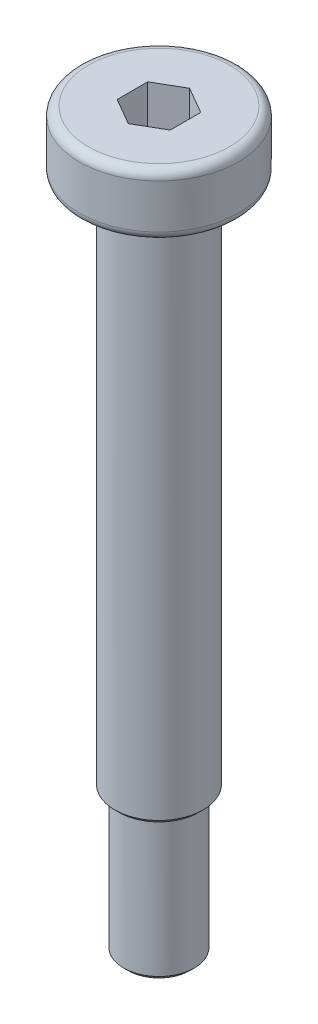
ISO-10303-21;
HEADER;
FILE_DESCRIPTION(('STEP AP214'),'2;1');
FILE_NAME('part.step','',(''),(''),'','','');
FILE_SCHEMA(('AUTOMOTIVE_DESIGN { 1 0 10303 214 1 1 1 1 }'));
ENDSEC;
DATA;
#1=APPLICATION_CONTEXT('core data for automotive mechanical design processes');
#2=APPLICATION_PROTOCOL_DEFINITION('international standard','automotive_design',2000,#1);
#3=PRODUCT_CONTEXT('',#1,'mechanical');
#4=PRODUCT('Part','Part','',(#3));
#5=PRODUCT_RELATED_PRODUCT_CATEGORY('part','',(#4));
#6=PRODUCT_DEFINITION_FORMATION('','',#4);
#7=PRODUCT_DEFINITION_CONTEXT('part definition',#1,'design');
#8=PRODUCT_DEFINITION('design','',#6,#7);
#9=PRODUCT_DEFINITION_SHAPE('','',#8);
#10=(LENGTH_UNIT() NAMED_UNIT(*) SI_UNIT(.MILLI.,.METRE.));
#11=(NAMED_UNIT(*) PLANE_ANGLE_UNIT() SI_UNIT($,.RADIAN.));
#12=(NAMED_UNIT(*) SI_UNIT($,.STERADIAN.) SOLID_ANGLE_UNIT());
#13=UNCERTAINTY_MEASURE_WITH_UNIT(LENGTH_MEASURE(1.E-05),#10,'distance_accuracy_value','');
#14=(GEOMETRIC_REPRESENTATION_CONTEXT(3) GLOBAL_UNCERTAINTY_ASSIGNED_CONTEXT((#13)) GLOBAL_UNIT_ASSIGNED_CONTEXT((#10,
#11,#12)) REPRESENTATION_CONTEXT('',''));
#15=CARTESIAN_POINT('',(0.,0.,0.));
#16=DIRECTION('',(0.,0.,1.));
#17=DIRECTION('',(1.,0.,0.));
#18=AXIS2_PLACEMENT_3D('',#15,#16,#17);
#19=CARTESIAN_POINT('',(0.,3.5,0.));
#20=DIRECTION('',(0.,1.,0.));
#21=DIRECTION('',(-1.,0.,0.));
#22=AXIS2_PLACEMENT_3D('',#19,#20,#21);
#23=CYLINDRICAL_SURFACE('',#22,2.25);
#24=CARTESIAN_POINT('',(0.,-1.,0.));
#25=DIRECTION('',(0.,1.,0.));
#26=DIRECTION('',(-1.,0.,0.));
#27=AXIS2_PLACEMENT_3D('',#24,#25,#26);
#28=CIRCLE('',#27,2.25);
#29=CARTESIAN_POINT('',(-2.25,-1.,0.));
#30=VERTEX_POINT('',#29);
#31=EDGE_CURVE('E119',#30,#30,#28,.T.);
#32=ORIENTED_EDGE('',*,*,#31,.T.);
#33=EDGE_LOOP('',(#32));
#34=FACE_BOUND('',#33,.T.);
#35=CARTESIAN_POINT('',(0.,0.,0.));
#36=DIRECTION('',(0.,1.,0.));
#37=DIRECTION('',(-1.,0.,0.));
#38=AXIS2_PLACEMENT_3D('',#35,#36,#37);
#39=CIRCLE('',#38,2.25);
#40=CARTESIAN_POINT('',(-2.25,0.,0.));
#41=VERTEX_POINT('',#40);
#42=EDGE_CURVE('E133',#41,#41,#39,.T.);
#43=ORIENTED_EDGE('',*,*,#42,.F.);
#44=EDGE_LOOP('',(#43));
#45=FACE_BOUND('',#44,.T.);
#46=ADVANCED_FACE('F16',(#34,#45),#23,.T.);
#47=CARTESIAN_POINT('',(-2.25,0.,0.));
#48=DIRECTION('',(0.,-1.,0.));
#49=DIRECTION('',(1.,0.,0.));
#50=AXIS2_PLACEMENT_3D('',#47,#48,#49);
#51=PLANE('',#50);
#52=CARTESIAN_POINT('',(0.,0.,0.));
#53=DIRECTION('',(0.,-1.,0.));
#54=DIRECTION('',(1.,0.,0.));
#55=AXIS2_PLACEMENT_3D('',#52,#53,#54);
#56=CIRCLE('',#55,4.);
#57=CARTESIAN_POINT('',(4.,0.,0.));
#58=VERTEX_POINT('',#57);
#59=EDGE_CURVE('E142',#58,#58,#56,.T.);
#60=ORIENTED_EDGE('',*,*,#59,.T.);
#61=EDGE_LOOP('',(#60));
#62=FACE_BOUND('',#61,.T.);
#63=ORIENTED_EDGE('',*,*,#42,.T.);
#64=EDGE_LOOP('',(#63));
#65=FACE_BOUND('',#64,.T.);
#66=ADVANCED_FACE('F170',(#62,#65),#51,.T.);
#67=CARTESIAN_POINT('',(0.,3.5,0.));
#68=DIRECTION('',(0.,1.,0.));
#69=DIRECTION('',(-1.,0.,0.));
#70=AXIS2_PLACEMENT_3D('',#67,#68,#69);
#71=CYLINDRICAL_SURFACE('',#70,4.5);
#72=CARTESIAN_POINT('',(0.,0.5,0.));
#73=DIRECTION('',(0.,-1.,0.));
#74=DIRECTION('',(1.,0.,0.));
#75=AXIS2_PLACEMENT_3D('',#72,#73,#74);
#76=CIRCLE('',#75,4.5);
#77=CARTESIAN_POINT('',(4.5,0.500000000000001,0.));
#78=VERTEX_POINT('',#77);
#79=EDGE_CURVE('E139',#78,#78,#76,.F.);
#80=ORIENTED_EDGE('',*,*,#79,.T.);
#81=EDGE_LOOP('',(#80));
#82=FACE_BOUND('',#81,.T.);
#83=CARTESIAN_POINT('',(0.,3.,0.));
#84=DIRECTION('',(0.,1.,0.));
#85=DIRECTION('',(-1.,0.,0.));
#86=AXIS2_PLACEMENT_3D('',#83,#84,#85);
#87=CIRCLE('',#86,4.5);
#88=CARTESIAN_POINT('',(-4.5,3.,0.));
#89=VERTEX_POINT('',#88);
#90=EDGE_CURVE('E136',#89,#89,#87,.F.);
#91=ORIENTED_EDGE('',*,*,#90,.T.);
#92=EDGE_LOOP('',(#91));
#93=FACE_BOUND('',#92,.T.);
#94=ADVANCED_FACE('F176',(#82,#93),#71,.T.);
#95=CARTESIAN_POINT('',(-4.5,3.5,0.));
#96=DIRECTION('',(0.,1.,0.));
#97=DIRECTION('',(-1.,0.,0.));
#98=AXIS2_PLACEMENT_3D('',#95,#96,#97);
#99=PLANE('',#98);
#100=CARTESIAN_POINT('',(0.,3.5,0.));
#101=DIRECTION('',(0.,1.,0.));
#102=DIRECTION('',(-1.,0.,0.));
#103=AXIS2_PLACEMENT_3D('',#100,#101,#102);
#104=CIRCLE('',#103,4.);
#105=CARTESIAN_POINT('',(-4.,3.5,0.));
#106=VERTEX_POINT('',#105);
#107=EDGE_CURVE('E145',#106,#106,#104,.T.);
#108=ORIENTED_EDGE('',*,*,#107,.T.);
#109=EDGE_LOOP('',(#108));
#110=FACE_BOUND('',#109,.T.);
#111=DIRECTION('',(-0.866025403784439,0.,-0.5));
#112=VECTOR('',#111,1.);
#113=CARTESIAN_POINT('',(1.5,3.5,-0.866025403784439));
#114=LINE('',#113,#112);
#115=CARTESIAN_POINT('',(1.5,3.5,-0.866025403784439));
#116=VERTEX_POINT('',#115);
#117=CARTESIAN_POINT('',(0.,3.5,-1.73205080756887));
#118=VERTEX_POINT('',#117);
#119=EDGE_CURVE('E32',#116,#118,#114,.T.);
#120=ORIENTED_EDGE('',*,*,#119,.F.);
#121=DIRECTION('',(0.,0.,-1.));
#122=VECTOR('',#121,1.);
#123=CARTESIAN_POINT('',(1.5,3.5,0.86602540378444));
#124=LINE('',#123,#122);
#125=CARTESIAN_POINT('',(1.5,3.5,0.86602540378444));
#126=VERTEX_POINT('',#125);
#127=EDGE_CURVE('E115',#126,#116,#124,.T.);
#128=ORIENTED_EDGE('',*,*,#127,.F.);
#129=DIRECTION('',(0.866025403784439,0.,-0.5));
#130=VECTOR('',#129,1.);
#131=CARTESIAN_POINT('',(0.,3.5,1.73205080756888));
#132=LINE('',#131,#130);
#133=CARTESIAN_POINT('',(0.,3.5,1.73205080756888));
#134=VERTEX_POINT('',#133);
#135=EDGE_CURVE('E113',#134,#126,#132,.T.);
#136=ORIENTED_EDGE('',*,*,#135,.F.);
#137=DIRECTION('',(0.866025403784439,0.,0.5));
#138=VECTOR('',#137,1.);
#139=CARTESIAN_POINT('',(-1.5,3.5,0.86602540378444));
#140=LINE('',#139,#138);
#141=CARTESIAN_POINT('',(-1.5,3.5,0.86602540378444));
#142=VERTEX_POINT('',#141);
#143=EDGE_CURVE('E80',#142,#134,#140,.T.);
#144=ORIENTED_EDGE('',*,*,#143,.F.);
#145=DIRECTION('',(0.,0.,1.));
#146=VECTOR('',#145,1.);
#147=CARTESIAN_POINT('',(-1.5,3.5,-0.866025403784439));
#148=LINE('',#147,#146);
#149=CARTESIAN_POINT('',(-1.5,3.5,-0.866025403784439));
#150=VERTEX_POINT('',#149);
#151=EDGE_CURVE('E109',#150,#142,#148,.T.);
#152=ORIENTED_EDGE('',*,*,#151,.F.);
#153=DIRECTION('',(-0.866025403784439,0.,0.5));
#154=VECTOR('',#153,1.);
#155=CARTESIAN_POINT('',(0.,3.5,-1.73205080756887));
#156=LINE('',#155,#154);
#157=EDGE_CURVE('E106',#118,#150,#156,.T.);
#158=ORIENTED_EDGE('',*,*,#157,.F.);
#159=EDGE_LOOP('',(#120,#128,#136,#144,#152,#158));
#160=FACE_BOUND('',#159,.T.);
#161=ADVANCED_FACE('F202',(#110,#160),#99,.T.);
#162=CARTESIAN_POINT('',(-2.,-38.,0.));
#163=DIRECTION('',(0.,-1.,0.));
#164=DIRECTION('',(1.,0.,0.));
#165=AXIS2_PLACEMENT_3D('',#162,#163,#164);
#166=PLANE('',#165);
#167=CARTESIAN_POINT('',(0.,-38.,0.));
#168=DIRECTION('',(0.,-1.,0.));
#169=DIRECTION('',(1.,0.,0.));
#170=AXIS2_PLACEMENT_3D('',#167,#168,#169);
#171=CIRCLE('',#170,1.75);
#172=CARTESIAN_POINT('',(1.75000000000001,-38.,0.));
#173=VERTEX_POINT('',#172);
#174=EDGE_CURVE('E151',#173,#173,#171,.T.);
#175=ORIENTED_EDGE('',*,*,#174,.T.);
#176=EDGE_LOOP('',(#175));
#177=FACE_BOUND('',#176,.T.);
#178=ADVANCED_FACE('F205',(#177),#166,.T.);
#179=CARTESIAN_POINT('',(0.,3.5,0.));
#180=DIRECTION('',(0.,1.,0.));
#181=DIRECTION('',(-1.,0.,0.));
#182=AXIS2_PLACEMENT_3D('',#179,#180,#181);
#183=CYLINDRICAL_SURFACE('',#182,2.);
#184=CARTESIAN_POINT('',(0.,-37.75,0.));
#185=DIRECTION('',(0.,-1.,0.));
#186=DIRECTION('',(1.,0.,0.));
#187=AXIS2_PLACEMENT_3D('',#184,#185,#186);
#188=CIRCLE('',#187,2.);
#189=CARTESIAN_POINT('',(2.00000000000001,-37.75,0.));
#190=VERTEX_POINT('',#189);
#191=EDGE_CURVE('E148',#190,#190,#188,.F.);
#192=ORIENTED_EDGE('',*,*,#191,.T.);
#193=EDGE_LOOP('',(#192));
#194=FACE_BOUND('',#193,.T.);
#195=CARTESIAN_POINT('',(0.,-30.,0.));
#196=DIRECTION('',(0.,1.,0.));
#197=DIRECTION('',(-1.,0.,0.));
#198=AXIS2_PLACEMENT_3D('',#195,#196,#197);
#199=CIRCLE('',#198,2.);
#200=CARTESIAN_POINT('',(-2.,-30.,0.));
#201=VERTEX_POINT('',#200);
#202=EDGE_CURVE('E130',#201,#201,#199,.T.);
#203=ORIENTED_EDGE('',*,*,#202,.F.);
#204=EDGE_LOOP('',(#203));
#205=FACE_BOUND('',#204,.T.);
#206=ADVANCED_FACE('F233',(#194,#205),#183,.T.);
#207=CARTESIAN_POINT('',(-2.5,-30.,0.));
#208=DIRECTION('',(0.,-1.,0.));
#209=DIRECTION('',(1.,0.,0.));
#210=AXIS2_PLACEMENT_3D('',#207,#208,#209);
#211=PLANE('',#210);
#212=CARTESIAN_POINT('',(0.,-30.,0.));
#213=DIRECTION('',(0.,-1.,0.));
#214=DIRECTION('',(1.,0.,0.));
#215=AXIS2_PLACEMENT_3D('',#212,#213,#214);
#216=CIRCLE('',#215,2.25);
#217=CARTESIAN_POINT('',(2.25,-30.,0.));
#218=VERTEX_POINT('',#217);
#219=EDGE_CURVE('E11',#218,#218,#216,.T.);
#220=ORIENTED_EDGE('',*,*,#219,.T.);
#221=EDGE_LOOP('',(#220));
#222=FACE_BOUND('',#221,.T.);
#223=ORIENTED_EDGE('',*,*,#202,.T.);
#224=EDGE_LOOP('',(#223));
#225=FACE_BOUND('',#224,.T.);
#226=ADVANCED_FACE('F230',(#222,#225),#211,.T.);
#227=CARTESIAN_POINT('',(0.,3.5,0.));
#228=DIRECTION('',(0.,1.,0.));
#229=DIRECTION('',(-1.,0.,0.));
#230=AXIS2_PLACEMENT_3D('',#227,#228,#229);
#231=CYLINDRICAL_SURFACE('',#230,2.5);
#232=CARTESIAN_POINT('',(0.,-29.75,0.));
#233=DIRECTION('',(0.,-1.,0.));
#234=DIRECTION('',(1.,0.,0.));
#235=AXIS2_PLACEMENT_3D('',#232,#233,#234);
#236=CIRCLE('',#235,2.5);
#237=CARTESIAN_POINT('',(2.5,-29.75,0.));
#238=VERTEX_POINT('',#237);
#239=EDGE_CURVE('E25',#238,#238,#236,.F.);
#240=ORIENTED_EDGE('',*,*,#239,.T.);
#241=EDGE_LOOP('',(#240));
#242=FACE_BOUND('',#241,.T.);
#243=CARTESIAN_POINT('',(0.,-1.,0.));
#244=DIRECTION('',(0.,1.,0.));
#245=DIRECTION('',(-1.,0.,0.));
#246=AXIS2_PLACEMENT_3D('',#243,#244,#245);
#247=CIRCLE('',#246,2.5);
#248=CARTESIAN_POINT('',(-2.5,-1.,0.));
#249=VERTEX_POINT('',#248);
#250=EDGE_CURVE('E127',#249,#249,#247,.T.);
#251=ORIENTED_EDGE('',*,*,#250,.F.);
#252=EDGE_LOOP('',(#251));
#253=FACE_BOUND('',#252,.T.);
#254=ADVANCED_FACE('F156',(#242,#253),#231,.T.);
#255=CARTESIAN_POINT('',(-2.25,-1.,0.));
#256=DIRECTION('',(0.,1.,0.));
#257=DIRECTION('',(-1.,0.,0.));
#258=AXIS2_PLACEMENT_3D('',#255,#256,#257);
#259=PLANE('',#258);
#260=ORIENTED_EDGE('',*,*,#250,.T.);
#261=EDGE_LOOP('',(#260));
#262=FACE_BOUND('',#261,.T.);
#263=ORIENTED_EDGE('',*,*,#31,.F.);
#264=EDGE_LOOP('',(#263));
#265=FACE_BOUND('',#264,.T.);
#266=ADVANCED_FACE('F216',(#262,#265),#259,.T.);
#267=CARTESIAN_POINT('',(1.5,1.1,-0.866025403784439));
#268=DIRECTION('',(0.5,0.,-0.866025403784439));
#269=DIRECTION('',(-0.866025403784439,0.,-0.5));
#270=AXIS2_PLACEMENT_3D('',#267,#268,#269);
#271=PLANE('',#270);
#272=ORIENTED_EDGE('',*,*,#119,.T.);
#273=DIRECTION('',(0.,1.,0.));
#274=VECTOR('',#273,1.);
#275=CARTESIAN_POINT('',(0.,1.1,-1.73205080756887));
#276=LINE('',#275,#274);
#277=CARTESIAN_POINT('',(0.,1.1,-1.73205080756887));
#278=VERTEX_POINT('',#277);
#279=EDGE_CURVE('E62',#278,#118,#276,.T.);
#280=ORIENTED_EDGE('',*,*,#279,.F.);
#281=DIRECTION('',(-0.866025403784439,0.,-0.5));
#282=VECTOR('',#281,1.);
#283=CARTESIAN_POINT('',(1.5,1.1,-0.866025403784439));
#284=LINE('',#283,#282);
#285=CARTESIAN_POINT('',(1.5,1.1,-0.866025403784439));
#286=VERTEX_POINT('',#285);
#287=EDGE_CURVE('E117',#286,#278,#284,.T.);
#288=ORIENTED_EDGE('',*,*,#287,.F.);
#289=DIRECTION('',(0.,1.,0.));
#290=VECTOR('',#289,1.);
#291=CARTESIAN_POINT('',(1.5,1.1,-0.866025403784439));
#292=LINE('',#291,#290);
#293=EDGE_CURVE('E40',#286,#116,#292,.T.);
#294=ORIENTED_EDGE('',*,*,#293,.T.);
#295=EDGE_LOOP('',(#272,#280,#288,#294));
#296=FACE_BOUND('',#295,.T.);
#297=ADVANCED_FACE('F213',(#296),#271,.F.);
#298=CARTESIAN_POINT('',(1.5,1.1,0.86602540378444));
#299=DIRECTION('',(1.,0.,0.));
#300=DIRECTION('',(0.,1.,0.));
#301=AXIS2_PLACEMENT_3D('',#298,#299,#300);
#302=PLANE('',#301);
#303=ORIENTED_EDGE('',*,*,#127,.T.);
#304=ORIENTED_EDGE('',*,*,#293,.F.);
#305=DIRECTION('',(0.,0.,-1.));
#306=VECTOR('',#305,1.);
#307=CARTESIAN_POINT('',(1.5,1.1,0.86602540378444));
#308=LINE('',#307,#306);
#309=CARTESIAN_POINT('',(1.5,1.1,0.86602540378444));
#310=VERTEX_POINT('',#309);
#311=EDGE_CURVE('E92',#310,#286,#308,.T.);
#312=ORIENTED_EDGE('',*,*,#311,.F.);
#313=DIRECTION('',(0.,1.,0.));
#314=VECTOR('',#313,1.);
#315=CARTESIAN_POINT('',(1.5,1.1,0.86602540378444));
#316=LINE('',#315,#314);
#317=EDGE_CURVE('E84',#310,#126,#316,.T.);
#318=ORIENTED_EDGE('',*,*,#317,.T.);
#319=EDGE_LOOP('',(#303,#304,#312,#318));
#320=FACE_BOUND('',#319,.T.);
#321=ADVANCED_FACE('F215',(#320),#302,.F.);
#322=CARTESIAN_POINT('',(0.,1.1,1.73205080756888));
#323=DIRECTION('',(0.5,0.,0.866025403784439));
#324=DIRECTION('',(0.866025403784439,0.,-0.5));
#325=AXIS2_PLACEMENT_3D('',#322,#323,#324);
#326=PLANE('',#325);
#327=ORIENTED_EDGE('',*,*,#135,.T.);
#328=ORIENTED_EDGE('',*,*,#317,.F.);
#329=DIRECTION('',(0.866025403784439,0.,-0.5));
#330=VECTOR('',#329,1.);
#331=CARTESIAN_POINT('',(0.,1.1,1.73205080756888));
#332=LINE('',#331,#330);
#333=CARTESIAN_POINT('',(0.,1.1,1.73205080756888));
#334=VERTEX_POINT('',#333);
#335=EDGE_CURVE('E88',#334,#310,#332,.T.);
#336=ORIENTED_EDGE('',*,*,#335,.F.);
#337=DIRECTION('',(0.,1.,0.));
#338=VECTOR('',#337,1.);
#339=CARTESIAN_POINT('',(0.,1.1,1.73205080756888));
#340=LINE('',#339,#338);
#341=EDGE_CURVE('E73',#334,#134,#340,.T.);
#342=ORIENTED_EDGE('',*,*,#341,.T.);
#343=EDGE_LOOP('',(#327,#328,#336,#342));
#344=FACE_BOUND('',#343,.T.);
#345=ADVANCED_FACE('F89',(#344),#326,.F.);
#346=CARTESIAN_POINT('',(-1.5,1.1,0.86602540378444));
#347=DIRECTION('',(-0.5,0.,0.866025403784439));
#348=DIRECTION('',(0.866025403784439,0.,0.5));
#349=AXIS2_PLACEMENT_3D('',#346,#347,#348);
#350=PLANE('',#349);
#351=ORIENTED_EDGE('',*,*,#143,.T.);
#352=ORIENTED_EDGE('',*,*,#341,.F.);
#353=DIRECTION('',(0.866025403784439,0.,0.5));
#354=VECTOR('',#353,1.);
#355=CARTESIAN_POINT('',(-1.5,1.1,0.86602540378444));
#356=LINE('',#355,#354);
#357=CARTESIAN_POINT('',(-1.5,1.1,0.86602540378444));
#358=VERTEX_POINT('',#357);
#359=EDGE_CURVE('E77',#358,#334,#356,.T.);
#360=ORIENTED_EDGE('',*,*,#359,.F.);
#361=DIRECTION('',(0.,1.,0.));
#362=VECTOR('',#361,1.);
#363=CARTESIAN_POINT('',(-1.5,1.1,0.86602540378444));
#364=LINE('',#363,#362);
#365=EDGE_CURVE('E85',#358,#142,#364,.T.);
#366=ORIENTED_EDGE('',*,*,#365,.T.);
#367=EDGE_LOOP('',(#351,#352,#360,#366));
#368=FACE_BOUND('',#367,.T.);
#369=ADVANCED_FACE('F75',(#368),#350,.F.);
#370=CARTESIAN_POINT('',(-1.5,1.1,-0.866025403784439));
#371=DIRECTION('',(-1.,0.,0.));
#372=DIRECTION('',(0.,-1.,0.));
#373=AXIS2_PLACEMENT_3D('',#370,#371,#372);
#374=PLANE('',#373);
#375=ORIENTED_EDGE('',*,*,#151,.T.);
#376=ORIENTED_EDGE('',*,*,#365,.F.);
#377=DIRECTION('',(0.,0.,1.));
#378=VECTOR('',#377,1.);
#379=CARTESIAN_POINT('',(-1.5,1.1,-0.866025403784439));
#380=LINE('',#379,#378);
#381=CARTESIAN_POINT('',(-1.5,1.1,-0.866025403784439));
#382=VERTEX_POINT('',#381);
#383=EDGE_CURVE('E98',#382,#358,#380,.T.);
#384=ORIENTED_EDGE('',*,*,#383,.F.);
#385=DIRECTION('',(0.,1.,0.));
#386=VECTOR('',#385,1.);
#387=CARTESIAN_POINT('',(-1.5,1.1,-0.866025403784439));
#388=LINE('',#387,#386);
#389=EDGE_CURVE('E122',#382,#150,#388,.T.);
#390=ORIENTED_EDGE('',*,*,#389,.T.);
#391=EDGE_LOOP('',(#375,#376,#384,#390));
#392=FACE_BOUND('',#391,.T.);
#393=ADVANCED_FACE('F312',(#392),#374,.F.);
#394=CARTESIAN_POINT('',(0.,1.1,-1.73205080756887));
#395=DIRECTION('',(-0.5,0.,-0.866025403784439));
#396=DIRECTION('',(-0.866025403784439,0.,0.5));
#397=AXIS2_PLACEMENT_3D('',#394,#395,#396);
#398=PLANE('',#397);
#399=ORIENTED_EDGE('',*,*,#157,.T.);
#400=ORIENTED_EDGE('',*,*,#389,.F.);
#401=DIRECTION('',(-0.866025403784439,0.,0.5));
#402=VECTOR('',#401,1.);
#403=CARTESIAN_POINT('',(0.,1.1,-1.73205080756887));
#404=LINE('',#403,#402);
#405=EDGE_CURVE('E100',#278,#382,#404,.T.);
#406=ORIENTED_EDGE('',*,*,#405,.F.);
#407=ORIENTED_EDGE('',*,*,#279,.T.);
#408=EDGE_LOOP('',(#399,#400,#406,#407));
#409=FACE_BOUND('',#408,.T.);
#410=ADVANCED_FACE('F211',(#409),#398,.F.);
#411=CARTESIAN_POINT('',(0.,1.1,0.));
#412=DIRECTION('',(0.,1.,0.));
#413=DIRECTION('',(0.,0.,1.));
#414=AXIS2_PLACEMENT_3D('',#411,#412,#413);
#415=PLANE('',#414);
#416=ORIENTED_EDGE('',*,*,#287,.T.);
#417=ORIENTED_EDGE('',*,*,#405,.T.);
#418=ORIENTED_EDGE('',*,*,#383,.T.);
#419=ORIENTED_EDGE('',*,*,#359,.T.);
#420=ORIENTED_EDGE('',*,*,#335,.T.);
#421=ORIENTED_EDGE('',*,*,#311,.T.);
#422=EDGE_LOOP('',(#416,#417,#418,#419,#420,#421));
#423=FACE_BOUND('',#422,.T.);
#424=ADVANCED_FACE('F95',(#423),#415,.T.);
#425=CARTESIAN_POINT('',(0.,0.5,0.));
#426=DIRECTION('',(0.,-1.,0.));
#427=DIRECTION('',(1.,0.,0.));
#428=AXIS2_PLACEMENT_3D('',#425,#426,#427);
#429=TOROIDAL_SURFACE('',#428,4.,0.5);
#430=ORIENTED_EDGE('',*,*,#59,.F.);
#431=EDGE_LOOP('',(#430));
#432=FACE_BOUND('',#431,.T.);
#433=ORIENTED_EDGE('',*,*,#79,.F.);
#434=EDGE_LOOP('',(#433));
#435=FACE_BOUND('',#434,.T.);
#436=ADVANCED_FACE('F182',(#432,#435),#429,.T.);
#437=CARTESIAN_POINT('',(0.,3.,0.));
#438=DIRECTION('',(0.,1.,0.));
#439=DIRECTION('',(-1.,0.,0.));
#440=AXIS2_PLACEMENT_3D('',#437,#438,#439);
#441=TOROIDAL_SURFACE('',#440,4.,0.5);
#442=ORIENTED_EDGE('',*,*,#90,.F.);
#443=EDGE_LOOP('',(#442));
#444=FACE_BOUND('',#443,.T.);
#445=ORIENTED_EDGE('',*,*,#107,.F.);
#446=EDGE_LOOP('',(#445));
#447=FACE_BOUND('',#446,.T.);
#448=ADVANCED_FACE('F166',(#444,#447),#441,.T.);
#449=CARTESIAN_POINT('',(0.,-37.75,0.));
#450=DIRECTION('',(0.,1.,0.));
#451=DIRECTION('',(-1.,0.,0.));
#452=AXIS2_PLACEMENT_3D('',#449,#450,#451);
#453=CONICAL_SURFACE('',#452,2.,0.785398163397442);
#454=ORIENTED_EDGE('',*,*,#174,.F.);
#455=EDGE_LOOP('',(#454));
#456=FACE_BOUND('',#455,.T.);
#457=ORIENTED_EDGE('',*,*,#191,.F.);
#458=EDGE_LOOP('',(#457));
#459=FACE_BOUND('',#458,.T.);
#460=ADVANCED_FACE('F160',(#456,#459),#453,.T.);
#461=CARTESIAN_POINT('',(0.,-29.75,0.));
#462=DIRECTION('',(0.,1.,0.));
#463=DIRECTION('',(-1.,0.,0.));
#464=AXIS2_PLACEMENT_3D('',#461,#462,#463);
#465=CONICAL_SURFACE('',#464,2.5,0.785398163397439);
#466=ORIENTED_EDGE('',*,*,#219,.F.);
#467=EDGE_LOOP('',(#466));
#468=FACE_BOUND('',#467,.T.);
#469=ORIENTED_EDGE('',*,*,#239,.F.);
#470=EDGE_LOOP('',(#469));
#471=FACE_BOUND('',#470,.T.);
#472=ADVANCED_FACE('F19',(#468,#471),#465,.T.);
#473=CLOSED_SHELL('',(#46,#66,#94,#161,#178,#206,#226,#254,#266,#297,#321,#345,#369,#393,#410,
#424,#436,#448,#460,#472));
#474=MANIFOLD_SOLID_BREP('B1',#473);
#475=ADVANCED_BREP_SHAPE_REPRESENTATION('',(#18,#474),#14);
#476=SHAPE_DEFINITION_REPRESENTATION(#9,#475);
ENDSEC;
END-ISO-10303-21;
